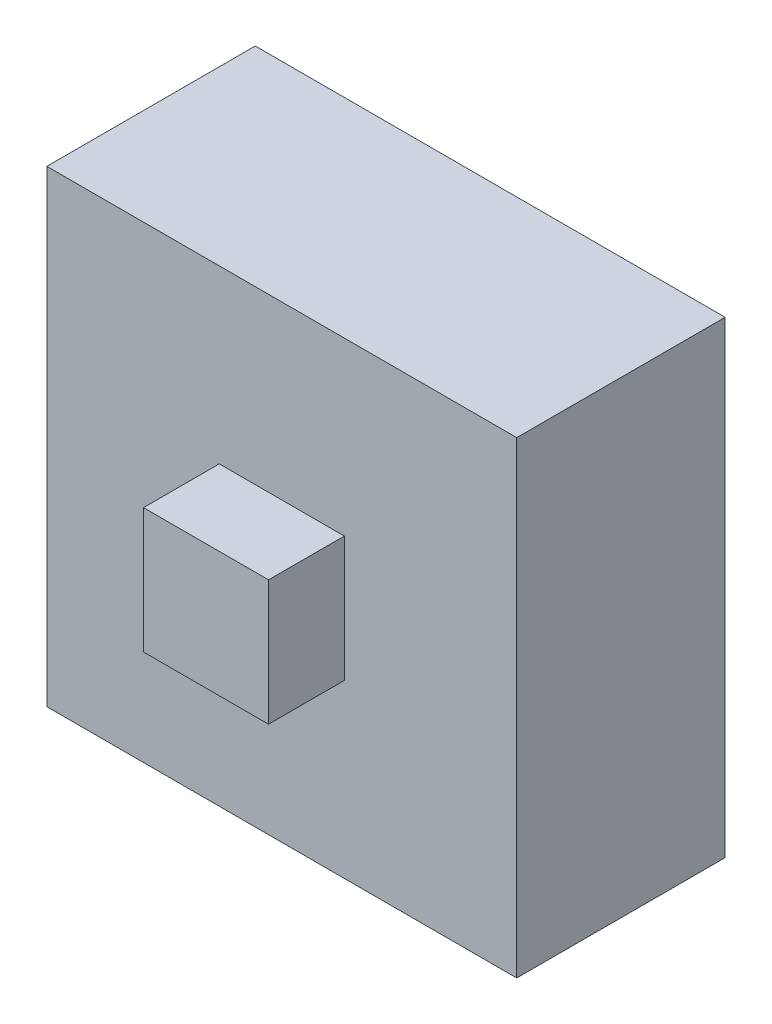
ISO-10303-21;
HEADER;
FILE_DESCRIPTION(('STEP AP214'),'2;1');
FILE_NAME('part.step','',(''),(''),'','','');
FILE_SCHEMA(('AUTOMOTIVE_DESIGN { 1 0 10303 214 1 1 1 1 }'));
ENDSEC;
DATA;
#1=APPLICATION_CONTEXT('core data for automotive mechanical design processes');
#2=APPLICATION_PROTOCOL_DEFINITION('international standard','automotive_design',2000,#1);
#3=PRODUCT_CONTEXT('',#1,'mechanical');
#4=PRODUCT('Part','Part','',(#3));
#5=PRODUCT_RELATED_PRODUCT_CATEGORY('part','',(#4));
#6=PRODUCT_DEFINITION_FORMATION('','',#4);
#7=PRODUCT_DEFINITION_CONTEXT('part definition',#1,'design');
#8=PRODUCT_DEFINITION('design','',#6,#7);
#9=PRODUCT_DEFINITION_SHAPE('','',#8);
#10=(LENGTH_UNIT() NAMED_UNIT(*) SI_UNIT(.MILLI.,.METRE.));
#11=(NAMED_UNIT(*) PLANE_ANGLE_UNIT() SI_UNIT($,.RADIAN.));
#12=(NAMED_UNIT(*) SI_UNIT($,.STERADIAN.) SOLID_ANGLE_UNIT());
#13=UNCERTAINTY_MEASURE_WITH_UNIT(LENGTH_MEASURE(1.E-05),#10,'distance_accuracy_value','');
#14=(GEOMETRIC_REPRESENTATION_CONTEXT(3) GLOBAL_UNCERTAINTY_ASSIGNED_CONTEXT((#13)) GLOBAL_UNIT_ASSIGNED_CONTEXT((#10,
#11,#12)) REPRESENTATION_CONTEXT('',''));
#15=CARTESIAN_POINT('',(0.,0.,0.));
#16=DIRECTION('',(0.,0.,1.));
#17=DIRECTION('',(1.,0.,0.));
#18=AXIS2_PLACEMENT_3D('',#15,#16,#17);
#19=CARTESIAN_POINT('',(-1.70848194626459,0.,0.));
#20=DIRECTION('',(-1.,0.,0.));
#21=DIRECTION('',(0.,-1.,0.));
#22=AXIS2_PLACEMENT_3D('',#19,#20,#21);
#23=PLANE('',#22);
#24=DIRECTION('',(0.,0.,-1.));
#25=VECTOR('',#24,1.);
#26=CARTESIAN_POINT('',(-1.7084819462646,12.6483548131194,18.5009285467941));
#27=LINE('',#26,#25);
#28=CARTESIAN_POINT('',(-1.7084819462646,12.6483548131194,1.));
#29=VERTEX_POINT('',#28);
#30=CARTESIAN_POINT('',(-1.7084819462646,12.6483548131194,-4.5));
#31=VERTEX_POINT('',#30);
#32=EDGE_CURVE('E153',#29,#31,#27,.T.);
#33=ORIENTED_EDGE('',*,*,#32,.T.);
#34=DIRECTION('',(0.,1.,0.));
#35=VECTOR('',#34,1.);
#36=CARTESIAN_POINT('',(-1.70848194626459,0.298354813119279,-4.5));
#37=LINE('',#36,#35);
#38=CARTESIAN_POINT('',(-1.70848194626459,0.298354813119279,-4.5));
#39=VERTEX_POINT('',#38);
#40=EDGE_CURVE('E140',#39,#31,#37,.T.);
#41=ORIENTED_EDGE('',*,*,#40,.F.);
#42=DIRECTION('',(0.,0.,-1.));
#43=VECTOR('',#42,1.);
#44=CARTESIAN_POINT('',(-1.70848194626459,0.298354813119279,18.5009285467941));
#45=LINE('',#44,#43);
#46=CARTESIAN_POINT('',(-1.7084819462646,0.298354813119279,1.));
#47=VERTEX_POINT('',#46);
#48=EDGE_CURVE('E151',#47,#39,#45,.T.);
#49=ORIENTED_EDGE('',*,*,#48,.F.);
#50=DIRECTION('',(0.,1.,0.));
#51=VECTOR('',#50,1.);
#52=CARTESIAN_POINT('',(-1.70848194626459,4.59835481311928,1.));
#53=LINE('',#52,#51);
#54=EDGE_CURVE('E229',#47,#29,#53,.T.);
#55=ORIENTED_EDGE('',*,*,#54,.T.);
#56=EDGE_LOOP('',(#33,#41,#49,#55));
#57=FACE_BOUND('',#56,.T.);
#58=ADVANCED_FACE('F39',(#57),#23,.T.);
#59=CARTESIAN_POINT('',(10.691518053735,0.,0.));
#60=DIRECTION('',(1.,0.,0.));
#61=DIRECTION('',(0.,0.,-1.));
#62=AXIS2_PLACEMENT_3D('',#59,#60,#61);
#63=PLANE('',#62);
#64=DIRECTION('',(0.,0.,-1.));
#65=VECTOR('',#64,1.);
#66=CARTESIAN_POINT('',(10.691518053735,0.298354813119279,18.5009285467941));
#67=LINE('',#66,#65);
#68=CARTESIAN_POINT('',(10.691518053735,0.298354813119279,1.));
#69=VERTEX_POINT('',#68);
#70=CARTESIAN_POINT('',(10.691518053735,0.298354813119279,-4.5));
#71=VERTEX_POINT('',#70);
#72=EDGE_CURVE('E162',#69,#71,#67,.T.);
#73=ORIENTED_EDGE('',*,*,#72,.T.);
#74=DIRECTION('',(0.,-1.,0.));
#75=VECTOR('',#74,1.);
#76=CARTESIAN_POINT('',(10.691518053735,12.6483548131194,-4.5));
#77=LINE('',#76,#75);
#78=CARTESIAN_POINT('',(10.691518053735,12.6483548131194,-4.5));
#79=VERTEX_POINT('',#78);
#80=EDGE_CURVE('E55',#79,#71,#77,.T.);
#81=ORIENTED_EDGE('',*,*,#80,.F.);
#82=DIRECTION('',(0.,0.,-1.));
#83=VECTOR('',#82,1.);
#84=CARTESIAN_POINT('',(10.691518053735,12.6483548131194,18.5009285467941));
#85=LINE('',#84,#83);
#86=CARTESIAN_POINT('',(10.691518053735,12.6483548131194,1.));
#87=VERTEX_POINT('',#86);
#88=EDGE_CURVE('E167',#87,#79,#85,.T.);
#89=ORIENTED_EDGE('',*,*,#88,.F.);
#90=DIRECTION('',(0.,-1.,0.));
#91=VECTOR('',#90,1.);
#92=CARTESIAN_POINT('',(10.691518053735,8.34835481311941,1.));
#93=LINE('',#92,#91);
#94=EDGE_CURVE('E226',#87,#69,#93,.T.);
#95=ORIENTED_EDGE('',*,*,#94,.T.);
#96=EDGE_LOOP('',(#73,#81,#89,#95));
#97=FACE_BOUND('',#96,.T.);
#98=ADVANCED_FACE('F303',(#97),#63,.T.);
#99=CARTESIAN_POINT('',(0.,12.6483548131194,0.));
#100=DIRECTION('',(0.,1.,0.));
#101=DIRECTION('',(-1.,0.,0.));
#102=AXIS2_PLACEMENT_3D('',#99,#100,#101);
#103=PLANE('',#102);
#104=ORIENTED_EDGE('',*,*,#88,.T.);
#105=DIRECTION('',(1.,0.,0.));
#106=VECTOR('',#105,1.);
#107=CARTESIAN_POINT('',(-1.7084819462646,12.6483548131194,-4.5));
#108=LINE('',#107,#106);
#109=EDGE_CURVE('E155',#31,#79,#108,.T.);
#110=ORIENTED_EDGE('',*,*,#109,.F.);
#111=ORIENTED_EDGE('',*,*,#32,.F.);
#112=DIRECTION('',(1.,0.,0.));
#113=VECTOR('',#112,1.);
#114=CARTESIAN_POINT('',(2.59151805373539,12.6483548131194,1.));
#115=LINE('',#114,#113);
#116=EDGE_CURVE('E222',#29,#87,#115,.T.);
#117=ORIENTED_EDGE('',*,*,#116,.T.);
#118=EDGE_LOOP('',(#104,#110,#111,#117));
#119=FACE_BOUND('',#118,.T.);
#120=ADVANCED_FACE('F308',(#119),#103,.T.);
#121=CARTESIAN_POINT('',(0.,0.298354813119279,0.));
#122=DIRECTION('',(0.,-1.,0.));
#123=DIRECTION('',(0.,0.,-1.));
#124=AXIS2_PLACEMENT_3D('',#121,#122,#123);
#125=PLANE('',#124);
#126=ORIENTED_EDGE('',*,*,#48,.T.);
#127=DIRECTION('',(-1.,0.,0.));
#128=VECTOR('',#127,1.);
#129=CARTESIAN_POINT('',(10.691518053735,0.298354813119279,-4.5));
#130=LINE('',#129,#128);
#131=EDGE_CURVE('E137',#71,#39,#130,.T.);
#132=ORIENTED_EDGE('',*,*,#131,.F.);
#133=ORIENTED_EDGE('',*,*,#72,.F.);
#134=DIRECTION('',(-1.,0.,0.));
#135=VECTOR('',#134,1.);
#136=CARTESIAN_POINT('',(6.39151805373495,0.298354813119279,1.));
#137=LINE('',#136,#135);
#138=EDGE_CURVE('E160',#69,#47,#137,.T.);
#139=ORIENTED_EDGE('',*,*,#138,.T.);
#140=EDGE_LOOP('',(#126,#132,#133,#139));
#141=FACE_BOUND('',#140,.T.);
#142=ADVANCED_FACE('F158',(#141),#125,.T.);
#143=CARTESIAN_POINT('',(6.14151805373495,5.62335481311928,3.));
#144=DIRECTION('',(-1.,0.,0.));
#145=DIRECTION('',(0.,0.,1.));
#146=AXIS2_PLACEMENT_3D('',#143,#144,#145);
#147=PLANE('',#146);
#148=DIRECTION('',(0.,1.,0.));
#149=VECTOR('',#148,1.);
#150=CARTESIAN_POINT('',(6.14151805373495,5.62335481311928,3.));
#151=LINE('',#150,#149);
#152=CARTESIAN_POINT('',(6.14151805373495,4.82335481311928,3.));
#153=VERTEX_POINT('',#152);
#154=CARTESIAN_POINT('',(6.14151805373495,8.12335481311928,3.));
#155=VERTEX_POINT('',#154);
#156=EDGE_CURVE('E253',#153,#155,#151,.T.);
#157=ORIENTED_EDGE('',*,*,#156,.F.);
#158=DIRECTION('',(0.,0.,1.));
#159=VECTOR('',#158,1.);
#160=CARTESIAN_POINT('',(6.14151805373495,4.82335481311928,-0.131370849898477));
#161=LINE('',#160,#159);
#162=CARTESIAN_POINT('',(6.14151805373495,4.82335481311928,1.));
#163=VERTEX_POINT('',#162);
#164=EDGE_CURVE('E232',#163,#153,#161,.T.);
#165=ORIENTED_EDGE('',*,*,#164,.F.);
#166=DIRECTION('',(0.,1.,0.));
#167=VECTOR('',#166,1.);
#168=CARTESIAN_POINT('',(6.14151805373495,5.62335481311928,1.));
#169=LINE('',#168,#167);
#170=CARTESIAN_POINT('',(6.14151805373495,8.12335481311928,1.));
#171=VERTEX_POINT('',#170);
#172=EDGE_CURVE('E250',#163,#171,#169,.T.);
#173=ORIENTED_EDGE('',*,*,#172,.T.);
#174=DIRECTION('',(0.,0.,-1.));
#175=VECTOR('',#174,1.);
#176=CARTESIAN_POINT('',(6.14151805373495,8.12335481311928,3.));
#177=LINE('',#176,#175);
#178=EDGE_CURVE('E48',#155,#171,#177,.T.);
#179=ORIENTED_EDGE('',*,*,#178,.F.);
#180=EDGE_LOOP('',(#157,#165,#173,#179));
#181=FACE_BOUND('',#180,.T.);
#182=ADVANCED_FACE('F41',(#181),#147,.F.);
#183=CARTESIAN_POINT('',(6.14151805373495,8.12335481311928,3.));
#184=DIRECTION('',(0.,-1.,0.));
#185=DIRECTION('',(0.,0.,-1.));
#186=AXIS2_PLACEMENT_3D('',#183,#184,#185);
#187=PLANE('',#186);
#188=ORIENTED_EDGE('',*,*,#178,.T.);
#189=DIRECTION('',(-1.,0.,0.));
#190=VECTOR('',#189,1.);
#191=CARTESIAN_POINT('',(6.14151805373495,8.12335481311928,1.));
#192=LINE('',#191,#190);
#193=CARTESIAN_POINT('',(2.84151805373495,8.12335481311928,1.));
#194=VERTEX_POINT('',#193);
#195=EDGE_CURVE('E240',#171,#194,#192,.T.);
#196=ORIENTED_EDGE('',*,*,#195,.T.);
#197=DIRECTION('',(0.,0.,-1.));
#198=VECTOR('',#197,1.);
#199=CARTESIAN_POINT('',(2.84151805373495,8.12335481311928,3.));
#200=LINE('',#199,#198);
#201=CARTESIAN_POINT('',(2.84151805373495,8.12335481311928,3.));
#202=VERTEX_POINT('',#201);
#203=EDGE_CURVE('E266',#202,#194,#200,.T.);
#204=ORIENTED_EDGE('',*,*,#203,.F.);
#205=DIRECTION('',(-1.,0.,0.));
#206=VECTOR('',#205,1.);
#207=CARTESIAN_POINT('',(6.14151805373495,8.12335481311928,3.));
#208=LINE('',#207,#206);
#209=EDGE_CURVE('E257',#155,#202,#208,.T.);
#210=ORIENTED_EDGE('',*,*,#209,.F.);
#211=EDGE_LOOP('',(#188,#196,#204,#210));
#212=FACE_BOUND('',#211,.T.);
#213=ADVANCED_FACE('F273',(#212),#187,.F.);
#214=CARTESIAN_POINT('',(2.84151805373495,8.12335481311928,3.));
#215=DIRECTION('',(1.,0.,0.));
#216=DIRECTION('',(0.,0.,-1.));
#217=AXIS2_PLACEMENT_3D('',#214,#215,#216);
#218=PLANE('',#217);
#219=ORIENTED_EDGE('',*,*,#203,.T.);
#220=DIRECTION('',(0.,-1.,0.));
#221=VECTOR('',#220,1.);
#222=CARTESIAN_POINT('',(2.84151805373495,8.12335481311928,1.));
#223=LINE('',#222,#221);
#224=CARTESIAN_POINT('',(2.84151805373495,4.82335481311928,1.));
#225=VERTEX_POINT('',#224);
#226=EDGE_CURVE('E244',#194,#225,#223,.T.);
#227=ORIENTED_EDGE('',*,*,#226,.T.);
#228=DIRECTION('',(0.,0.,1.));
#229=VECTOR('',#228,1.);
#230=CARTESIAN_POINT('',(2.84151805373495,4.82335481311928,-0.131370849898477));
#231=LINE('',#230,#229);
#232=CARTESIAN_POINT('',(2.84151805373495,4.82335481311928,3.));
#233=VERTEX_POINT('',#232);
#234=EDGE_CURVE('E236',#225,#233,#231,.T.);
#235=ORIENTED_EDGE('',*,*,#234,.T.);
#236=DIRECTION('',(0.,-1.,0.));
#237=VECTOR('',#236,1.);
#238=CARTESIAN_POINT('',(2.84151805373495,8.12335481311928,3.));
#239=LINE('',#238,#237);
#240=EDGE_CURVE('E260',#202,#233,#239,.T.);
#241=ORIENTED_EDGE('',*,*,#240,.F.);
#242=EDGE_LOOP('',(#219,#227,#235,#241));
#243=FACE_BOUND('',#242,.T.);
#244=ADVANCED_FACE('F286',(#243),#218,.F.);
#245=CARTESIAN_POINT('',(3.64151805373495,4.82335481311928,3.));
#246=DIRECTION('',(0.,1.,0.));
#247=DIRECTION('',(0.,0.,1.));
#248=AXIS2_PLACEMENT_3D('',#245,#246,#247);
#249=PLANE('',#248);
#250=DIRECTION('',(1.,0.,0.));
#251=VECTOR('',#250,1.);
#252=CARTESIAN_POINT('',(3.64151805373495,4.82335481311928,3.));
#253=LINE('',#252,#251);
#254=EDGE_CURVE('E263',#233,#153,#253,.T.);
#255=ORIENTED_EDGE('',*,*,#254,.F.);
#256=ORIENTED_EDGE('',*,*,#234,.F.);
#257=DIRECTION('',(1.,0.,0.));
#258=VECTOR('',#257,1.);
#259=CARTESIAN_POINT('',(3.64151805373495,4.82335481311928,1.));
#260=LINE('',#259,#258);
#261=EDGE_CURVE('E247',#225,#163,#260,.T.);
#262=ORIENTED_EDGE('',*,*,#261,.T.);
#263=ORIENTED_EDGE('',*,*,#164,.T.);
#264=EDGE_LOOP('',(#255,#256,#262,#263));
#265=FACE_BOUND('',#264,.T.);
#266=ADVANCED_FACE('F292',(#265),#249,.F.);
#267=CARTESIAN_POINT('',(0.,0.,3.));
#268=DIRECTION('',(0.,0.,1.));
#269=DIRECTION('',(1.,0.,0.));
#270=AXIS2_PLACEMENT_3D('',#267,#268,#269);
#271=PLANE('',#270);
#272=ORIENTED_EDGE('',*,*,#156,.T.);
#273=ORIENTED_EDGE('',*,*,#209,.T.);
#274=ORIENTED_EDGE('',*,*,#240,.T.);
#275=ORIENTED_EDGE('',*,*,#254,.T.);
#276=EDGE_LOOP('',(#272,#273,#274,#275));
#277=FACE_BOUND('',#276,.T.);
#278=ADVANCED_FACE('F290',(#277),#271,.T.);
#279=CARTESIAN_POINT('',(0.,0.,1.));
#280=DIRECTION('',(0.,0.,1.));
#281=DIRECTION('',(1.,0.,0.));
#282=AXIS2_PLACEMENT_3D('',#279,#280,#281);
#283=PLANE('',#282);
#284=ORIENTED_EDGE('',*,*,#261,.F.);
#285=ORIENTED_EDGE('',*,*,#226,.F.);
#286=ORIENTED_EDGE('',*,*,#195,.F.);
#287=ORIENTED_EDGE('',*,*,#172,.F.);
#288=EDGE_LOOP('',(#284,#285,#286,#287));
#289=FACE_BOUND('',#288,.T.);
#290=ORIENTED_EDGE('',*,*,#116,.F.);
#291=ORIENTED_EDGE('',*,*,#54,.F.);
#292=ORIENTED_EDGE('',*,*,#138,.F.);
#293=ORIENTED_EDGE('',*,*,#94,.F.);
#294=EDGE_LOOP('',(#290,#291,#292,#293));
#295=FACE_BOUND('',#294,.T.);
#296=ADVANCED_FACE('F282',(#289,#295),#283,.T.);
#297=CARTESIAN_POINT('',(0.,0.,-4.5));
#298=DIRECTION('',(0.,0.,-1.));
#299=DIRECTION('',(-1.,0.,0.));
#300=AXIS2_PLACEMENT_3D('',#297,#298,#299);
#301=PLANE('',#300);
#302=ORIENTED_EDGE('',*,*,#80,.T.);
#303=ORIENTED_EDGE('',*,*,#131,.T.);
#304=ORIENTED_EDGE('',*,*,#40,.T.);
#305=ORIENTED_EDGE('',*,*,#109,.T.);
#306=EDGE_LOOP('',(#302,#303,#304,#305));
#307=FACE_BOUND('',#306,.T.);
#308=DIRECTION('',(0.,1.,0.));
#309=VECTOR('',#308,1.);
#310=CARTESIAN_POINT('',(6.39151805373495,7.12335481311928,-4.5));
#311=LINE('',#310,#309);
#312=CARTESIAN_POINT('',(6.39151805373495,5.72690820371256,-4.5));
#313=VERTEX_POINT('',#312);
#314=CARTESIAN_POINT('',(6.39151805373495,8.37335481311928,-4.5));
#315=VERTEX_POINT('',#314);
#316=EDGE_CURVE('E163',#313,#315,#311,.T.);
#317=ORIENTED_EDGE('',*,*,#316,.T.);
#318=DIRECTION('',(-1.,0.,0.));
#319=VECTOR('',#318,1.);
#320=CARTESIAN_POINT('',(6.39151805373495,8.37335481311928,-4.5));
#321=LINE('',#320,#319);
#322=CARTESIAN_POINT('',(2.59151805373495,8.37335481311928,-4.5));
#323=VERTEX_POINT('',#322);
#324=EDGE_CURVE('E169',#315,#323,#321,.T.);
#325=ORIENTED_EDGE('',*,*,#324,.T.);
#326=DIRECTION('',(0.,-1.,0.));
#327=VECTOR('',#326,1.);
#328=CARTESIAN_POINT('',(2.59151805373495,8.37335481311928,-4.5));
#329=LINE('',#328,#327);
#330=CARTESIAN_POINT('',(2.59151805373495,5.72690820371256,-4.5));
#331=VERTEX_POINT('',#330);
#332=EDGE_CURVE('E349',#323,#331,#329,.T.);
#333=ORIENTED_EDGE('',*,*,#332,.T.);
#334=DIRECTION('',(0.707106781186546,-0.707106781186549,0.));
#335=VECTOR('',#334,1.);
#336=CARTESIAN_POINT('',(3.16829474903158,5.15013150841594,-4.5));
#337=LINE('',#336,#335);
#338=CARTESIAN_POINT('',(3.74507144432812,4.57335481311938,-4.5));
#339=VERTEX_POINT('',#338);
#340=EDGE_CURVE('E345',#331,#339,#337,.T.);
#341=ORIENTED_EDGE('',*,*,#340,.T.);
#342=DIRECTION('',(1.,0.,0.));
#343=VECTOR('',#342,1.);
#344=CARTESIAN_POINT('',(3.74507144432812,4.57335481311938,-4.5));
#345=LINE('',#344,#343);
#346=CARTESIAN_POINT('',(5.23796466314175,4.57335481311938,-4.5));
#347=VERTEX_POINT('',#346);
#348=EDGE_CURVE('E62',#339,#347,#345,.T.);
#349=ORIENTED_EDGE('',*,*,#348,.T.);
#350=DIRECTION('',(0.707106781186553,0.707106781186542,0.));
#351=VECTOR('',#350,1.);
#352=CARTESIAN_POINT('',(5.81474135843832,5.15013150841594,-4.5));
#353=LINE('',#352,#351);
#354=EDGE_CURVE('E11',#347,#313,#353,.T.);
#355=ORIENTED_EDGE('',*,*,#354,.T.);
#356=EDGE_LOOP('',(#317,#325,#333,#341,#349,#355));
#357=FACE_BOUND('',#356,.T.);
#358=ADVANCED_FACE('F139',(#307,#357),#301,.T.);
#359=CARTESIAN_POINT('',(0.,0.,0.));
#360=DIRECTION('',(0.,0.,1.));
#361=DIRECTION('',(1.,0.,0.));
#362=AXIS2_PLACEMENT_3D('',#359,#360,#361);
#363=PLANE('',#362);
#364=DIRECTION('',(0.,-1.,0.));
#365=VECTOR('',#364,1.);
#366=CARTESIAN_POINT('',(6.39151805373495,7.12335481311928,0.));
#367=LINE('',#366,#365);
#368=CARTESIAN_POINT('',(6.39151805373495,8.37335481311928,0.));
#369=VERTEX_POINT('',#368);
#370=CARTESIAN_POINT('',(6.39151805373495,5.72690820371256,0.));
#371=VERTEX_POINT('',#370);
#372=EDGE_CURVE('E178',#369,#371,#367,.T.);
#373=ORIENTED_EDGE('',*,*,#372,.T.);
#374=DIRECTION('',(-0.707106781186553,-0.707106781186542,0.));
#375=VECTOR('',#374,1.);
#376=CARTESIAN_POINT('',(6.39151805373495,5.72690820371256,0.));
#377=LINE('',#376,#375);
#378=CARTESIAN_POINT('',(5.23796466314175,4.57335481311938,0.));
#379=VERTEX_POINT('',#378);
#380=EDGE_CURVE('E181',#371,#379,#377,.T.);
#381=ORIENTED_EDGE('',*,*,#380,.T.);
#382=DIRECTION('',(-1.,0.,0.));
#383=VECTOR('',#382,1.);
#384=CARTESIAN_POINT('',(5.23796466314175,4.57335481311938,0.));
#385=LINE('',#384,#383);
#386=CARTESIAN_POINT('',(3.74507144432812,4.57335481311938,0.));
#387=VERTEX_POINT('',#386);
#388=EDGE_CURVE('E184',#379,#387,#385,.T.);
#389=ORIENTED_EDGE('',*,*,#388,.T.);
#390=DIRECTION('',(-0.707106781186541,0.707106781186554,0.));
#391=VECTOR('',#390,1.);
#392=CARTESIAN_POINT('',(3.16829474903158,5.15013150841594,0.));
#393=LINE('',#392,#391);
#394=CARTESIAN_POINT('',(2.59151805373495,5.72690820371256,0.));
#395=VERTEX_POINT('',#394);
#396=EDGE_CURVE('E187',#387,#395,#393,.T.);
#397=ORIENTED_EDGE('',*,*,#396,.T.);
#398=DIRECTION('',(0.,1.,0.));
#399=VECTOR('',#398,1.);
#400=CARTESIAN_POINT('',(2.59151805373495,5.72690820371256,0.));
#401=LINE('',#400,#399);
#402=CARTESIAN_POINT('',(2.59151805373495,8.37335481311928,0.));
#403=VERTEX_POINT('',#402);
#404=EDGE_CURVE('E190',#395,#403,#401,.T.);
#405=ORIENTED_EDGE('',*,*,#404,.T.);
#406=DIRECTION('',(1.,0.,0.));
#407=VECTOR('',#406,1.);
#408=CARTESIAN_POINT('',(4.49151805373492,8.37335481311928,0.));
#409=LINE('',#408,#407);
#410=EDGE_CURVE('E193',#403,#369,#409,.T.);
#411=ORIENTED_EDGE('',*,*,#410,.T.);
#412=EDGE_LOOP('',(#373,#381,#389,#397,#405,#411));
#413=FACE_BOUND('',#412,.T.);
#414=ADVANCED_FACE('F314',(#413),#363,.F.);
#415=CARTESIAN_POINT('',(5.81474135843832,5.15013150841594,0.));
#416=DIRECTION('',(0.707106781186542,-0.707106781186553,0.));
#417=DIRECTION('',(0.707106781186553,0.707106781186542,0.));
#418=AXIS2_PLACEMENT_3D('',#415,#416,#417);
#419=PLANE('',#418);
#420=ORIENTED_EDGE('',*,*,#354,.F.);
#421=DIRECTION('',(0.,0.,-1.));
#422=VECTOR('',#421,1.);
#423=CARTESIAN_POINT('',(5.23796466314175,4.57335481311938,0.));
#424=LINE('',#423,#422);
#425=EDGE_CURVE('E213',#379,#347,#424,.T.);
#426=ORIENTED_EDGE('',*,*,#425,.F.);
#427=ORIENTED_EDGE('',*,*,#380,.F.);
#428=DIRECTION('',(0.,0.,-1.));
#429=VECTOR('',#428,1.);
#430=CARTESIAN_POINT('',(6.39151805373495,5.72690820371256,0.));
#431=LINE('',#430,#429);
#432=EDGE_CURVE('E196',#371,#313,#431,.T.);
#433=ORIENTED_EDGE('',*,*,#432,.T.);
#434=EDGE_LOOP('',(#420,#426,#427,#433));
#435=FACE_BOUND('',#434,.T.);
#436=ADVANCED_FACE('F316',(#435),#419,.F.);
#437=CARTESIAN_POINT('',(3.74507144432812,4.57335481311938,0.));
#438=DIRECTION('',(0.,-1.,0.));
#439=DIRECTION('',(0.,0.,-1.));
#440=AXIS2_PLACEMENT_3D('',#437,#438,#439);
#441=PLANE('',#440);
#442=ORIENTED_EDGE('',*,*,#348,.F.);
#443=DIRECTION('',(0.,0.,-1.));
#444=VECTOR('',#443,1.);
#445=CARTESIAN_POINT('',(3.74507144432812,4.57335481311938,0.));
#446=LINE('',#445,#444);
#447=EDGE_CURVE('E209',#387,#339,#446,.T.);
#448=ORIENTED_EDGE('',*,*,#447,.F.);
#449=ORIENTED_EDGE('',*,*,#388,.F.);
#450=ORIENTED_EDGE('',*,*,#425,.T.);
#451=EDGE_LOOP('',(#442,#448,#449,#450));
#452=FACE_BOUND('',#451,.T.);
#453=ADVANCED_FACE('F322',(#452),#441,.F.);
#454=CARTESIAN_POINT('',(3.16829474903158,5.15013150841594,0.));
#455=DIRECTION('',(-0.707106781186549,-0.707106781186546,0.));
#456=DIRECTION('',(0.707106781186546,-0.707106781186549,0.));
#457=AXIS2_PLACEMENT_3D('',#454,#455,#456);
#458=PLANE('',#457);
#459=ORIENTED_EDGE('',*,*,#340,.F.);
#460=DIRECTION('',(0.,0.,-1.));
#461=VECTOR('',#460,1.);
#462=CARTESIAN_POINT('',(2.59151805373495,5.72690820371256,0.));
#463=LINE('',#462,#461);
#464=EDGE_CURVE('E205',#395,#331,#463,.T.);
#465=ORIENTED_EDGE('',*,*,#464,.F.);
#466=ORIENTED_EDGE('',*,*,#396,.F.);
#467=ORIENTED_EDGE('',*,*,#447,.T.);
#468=EDGE_LOOP('',(#459,#465,#466,#467));
#469=FACE_BOUND('',#468,.T.);
#470=ADVANCED_FACE('F344',(#469),#458,.F.);
#471=CARTESIAN_POINT('',(2.59151805373495,8.37335481311928,0.));
#472=DIRECTION('',(-1.,0.,0.));
#473=DIRECTION('',(0.,0.,1.));
#474=AXIS2_PLACEMENT_3D('',#471,#472,#473);
#475=PLANE('',#474);
#476=ORIENTED_EDGE('',*,*,#332,.F.);
#477=DIRECTION('',(0.,0.,-1.));
#478=VECTOR('',#477,1.);
#479=CARTESIAN_POINT('',(2.59151805373495,8.37335481311928,0.));
#480=LINE('',#479,#478);
#481=EDGE_CURVE('E201',#403,#323,#480,.T.);
#482=ORIENTED_EDGE('',*,*,#481,.F.);
#483=ORIENTED_EDGE('',*,*,#404,.F.);
#484=ORIENTED_EDGE('',*,*,#464,.T.);
#485=EDGE_LOOP('',(#476,#482,#483,#484));
#486=FACE_BOUND('',#485,.T.);
#487=ADVANCED_FACE('F348',(#486),#475,.F.);
#488=CARTESIAN_POINT('',(6.39151805373495,8.37335481311928,0.));
#489=DIRECTION('',(0.,1.,0.));
#490=DIRECTION('',(0.,0.,1.));
#491=AXIS2_PLACEMENT_3D('',#488,#489,#490);
#492=PLANE('',#491);
#493=ORIENTED_EDGE('',*,*,#324,.F.);
#494=DIRECTION('',(0.,0.,-1.));
#495=VECTOR('',#494,1.);
#496=CARTESIAN_POINT('',(6.39151805373495,8.37335481311928,0.));
#497=LINE('',#496,#495);
#498=EDGE_CURVE('E197',#369,#315,#497,.T.);
#499=ORIENTED_EDGE('',*,*,#498,.F.);
#500=ORIENTED_EDGE('',*,*,#410,.F.);
#501=ORIENTED_EDGE('',*,*,#481,.T.);
#502=EDGE_LOOP('',(#493,#499,#500,#501));
#503=FACE_BOUND('',#502,.T.);
#504=ADVANCED_FACE('F352',(#503),#492,.F.);
#505=CARTESIAN_POINT('',(6.39151805373495,7.12335481311928,0.));
#506=DIRECTION('',(1.,0.,0.));
#507=DIRECTION('',(0.,0.,-1.));
#508=AXIS2_PLACEMENT_3D('',#505,#506,#507);
#509=PLANE('',#508);
#510=ORIENTED_EDGE('',*,*,#316,.F.);
#511=ORIENTED_EDGE('',*,*,#432,.F.);
#512=ORIENTED_EDGE('',*,*,#372,.F.);
#513=ORIENTED_EDGE('',*,*,#498,.T.);
#514=EDGE_LOOP('',(#510,#511,#512,#513));
#515=FACE_BOUND('',#514,.T.);
#516=ADVANCED_FACE('F334',(#515),#509,.F.);
#517=CLOSED_SHELL('',(#58,#98,#120,#142,#182,#213,#244,#266,#278,#296,#358,#414,#436,#453,#470,
#487,#504,#516));
#518=MANIFOLD_SOLID_BREP('B2',#517);
#519=ADVANCED_BREP_SHAPE_REPRESENTATION('',(#18,#518),#14);
#520=SHAPE_DEFINITION_REPRESENTATION(#9,#519);
ENDSEC;
END-ISO-10303-21;
